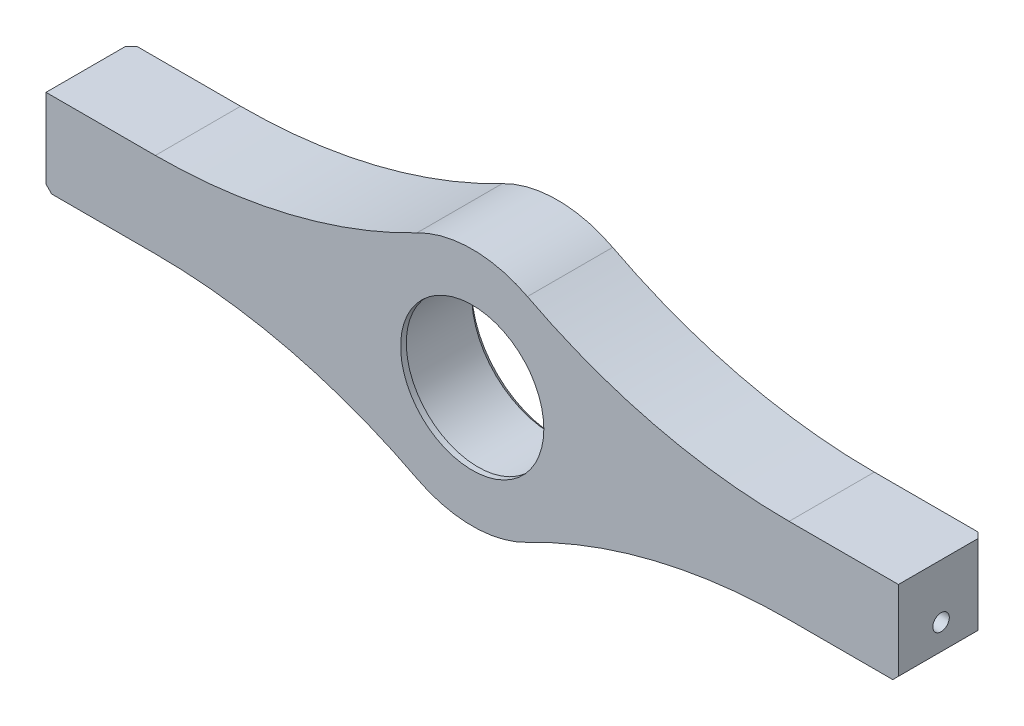
ISO-10303-21;
HEADER;
FILE_DESCRIPTION(('STEP AP214'),'2;1');
FILE_NAME('part.step','',(''),(''),'','','');
FILE_SCHEMA(('AUTOMOTIVE_DESIGN { 1 0 10303 214 1 1 1 1 }'));
ENDSEC;
DATA;
#1=APPLICATION_CONTEXT('core data for automotive mechanical design processes');
#2=APPLICATION_PROTOCOL_DEFINITION('international standard','automotive_design',2000,#1);
#3=PRODUCT_CONTEXT('',#1,'mechanical');
#4=PRODUCT('Part','Part','',(#3));
#5=PRODUCT_RELATED_PRODUCT_CATEGORY('part','',(#4));
#6=PRODUCT_DEFINITION_FORMATION('','',#4);
#7=PRODUCT_DEFINITION_CONTEXT('part definition',#1,'design');
#8=PRODUCT_DEFINITION('design','',#6,#7);
#9=PRODUCT_DEFINITION_SHAPE('','',#8);
#10=(LENGTH_UNIT() NAMED_UNIT(*) SI_UNIT(.MILLI.,.METRE.));
#11=(NAMED_UNIT(*) PLANE_ANGLE_UNIT() SI_UNIT($,.RADIAN.));
#12=(NAMED_UNIT(*) SI_UNIT($,.STERADIAN.) SOLID_ANGLE_UNIT());
#13=UNCERTAINTY_MEASURE_WITH_UNIT(LENGTH_MEASURE(1.E-05),#10,'distance_accuracy_value','');
#14=(GEOMETRIC_REPRESENTATION_CONTEXT(3) GLOBAL_UNCERTAINTY_ASSIGNED_CONTEXT((#13)) GLOBAL_UNIT_ASSIGNED_CONTEXT((#10,
#11,#12)) REPRESENTATION_CONTEXT('',''));
#15=CARTESIAN_POINT('',(0.,0.,0.));
#16=DIRECTION('',(0.,0.,1.));
#17=DIRECTION('',(1.,0.,0.));
#18=AXIS2_PLACEMENT_3D('',#15,#16,#17);
#19=CARTESIAN_POINT('',(0.,0.,15.));
#20=DIRECTION('',(0.,0.,-1.));
#21=DIRECTION('',(-1.,0.,0.));
#22=AXIS2_PLACEMENT_3D('',#19,#20,#21);
#23=CYLINDRICAL_SURFACE('',#22,14.1);
#24=CARTESIAN_POINT('',(0.,0.,1.00000000000001));
#25=DIRECTION('',(0.,0.,1.));
#26=DIRECTION('',(1.,0.,0.));
#27=AXIS2_PLACEMENT_3D('',#24,#25,#26);
#28=CIRCLE('',#27,14.1);
#29=CARTESIAN_POINT('',(14.1,0.,1.00000000000001));
#30=VERTEX_POINT('',#29);
#31=EDGE_CURVE('E212',#30,#30,#28,.F.);
#32=ORIENTED_EDGE('',*,*,#31,.T.);
#33=EDGE_LOOP('',(#32));
#34=FACE_BOUND('',#33,.T.);
#35=CARTESIAN_POINT('',(0.,0.,14.));
#36=DIRECTION('',(0.,0.,1.));
#37=DIRECTION('',(1.,0.,0.));
#38=AXIS2_PLACEMENT_3D('',#35,#36,#37);
#39=CIRCLE('',#38,14.1);
#40=CARTESIAN_POINT('',(14.1,0.,14.));
#41=VERTEX_POINT('',#40);
#42=EDGE_CURVE('E247',#41,#41,#39,.T.);
#43=ORIENTED_EDGE('',*,*,#42,.T.);
#44=EDGE_LOOP('',(#43));
#45=FACE_BOUND('',#44,.T.);
#46=ADVANCED_FACE('F33',(#34,#45),#23,.F.);
#47=CARTESIAN_POINT('',(0.,0.,15.));
#48=DIRECTION('',(0.,0.,1.));
#49=DIRECTION('',(1.,0.,0.));
#50=AXIS2_PLACEMENT_3D('',#47,#48,#49);
#51=PLANE('',#50);
#52=DIRECTION('',(0.,-1.,0.));
#53=VECTOR('',#52,1.);
#54=CARTESIAN_POINT('',(-75.,-7.5,15.));
#55=LINE('',#54,#53);
#56=CARTESIAN_POINT('',(-75.,7.5,15.));
#57=VERTEX_POINT('',#56);
#58=CARTESIAN_POINT('',(-75.,-6.49999999999998,15.));
#59=VERTEX_POINT('',#58);
#60=EDGE_CURVE('E281',#57,#59,#55,.T.);
#61=ORIENTED_EDGE('',*,*,#60,.T.);
#62=DIRECTION('',(-0.707106781186548,0.707106781186548,0.));
#63=VECTOR('',#62,1.);
#64=CARTESIAN_POINT('',(-40.75,-40.75,15.));
#65=LINE('',#64,#63);
#66=CARTESIAN_POINT('',(-74.,-7.5,15.));
#67=VERTEX_POINT('',#66);
#68=EDGE_CURVE('E223',#59,#67,#65,.F.);
#69=ORIENTED_EDGE('',*,*,#68,.T.);
#70=DIRECTION('',(1.,0.,0.));
#71=VECTOR('',#70,1.);
#72=CARTESIAN_POINT('',(-75.,-7.5,15.));
#73=LINE('',#72,#71);
#74=CARTESIAN_POINT('',(-55.758048746347,-7.5,15.));
#75=VERTEX_POINT('',#74);
#76=EDGE_CURVE('E283',#67,#75,#73,.T.);
#77=ORIENTED_EDGE('',*,*,#76,.T.);
#78=CARTESIAN_POINT('',(-55.758048746347,-107.5,15.));
#79=DIRECTION('',(0.,0.,1.));
#80=DIRECTION('',(1.,0.,0.));
#81=AXIS2_PLACEMENT_3D('',#78,#79,#80);
#82=CIRCLE('',#81,100.);
#83=CARTESIAN_POINT('',(-9.71506877413641,-18.7303881090008,15.));
#84=VERTEX_POINT('',#83);
#85=EDGE_CURVE('E198',#75,#84,#82,.F.);
#86=ORIENTED_EDGE('',*,*,#85,.T.);
#87=CARTESIAN_POINT('',(0.,0.,15.));
#88=DIRECTION('',(0.,0.,1.));
#89=DIRECTION('',(1.,0.,0.));
#90=AXIS2_PLACEMENT_3D('',#87,#88,#89);
#91=CIRCLE('',#90,21.1);
#92=CARTESIAN_POINT('',(9.71506877413644,-18.7303881090008,15.));
#93=VERTEX_POINT('',#92);
#94=EDGE_CURVE('E285',#84,#93,#91,.T.);
#95=ORIENTED_EDGE('',*,*,#94,.T.);
#96=CARTESIAN_POINT('',(55.758048746347,-107.5,15.));
#97=DIRECTION('',(0.,0.,1.));
#98=DIRECTION('',(1.,0.,0.));
#99=AXIS2_PLACEMENT_3D('',#96,#97,#98);
#100=CIRCLE('',#99,100.);
#101=CARTESIAN_POINT('',(55.758048746347,-7.5,15.));
#102=VERTEX_POINT('',#101);
#103=EDGE_CURVE('E193',#93,#102,#100,.F.);
#104=ORIENTED_EDGE('',*,*,#103,.T.);
#105=DIRECTION('',(1.,0.,0.));
#106=VECTOR('',#105,1.);
#107=CARTESIAN_POINT('',(19.7220688569937,-7.5,15.));
#108=LINE('',#107,#106);
#109=CARTESIAN_POINT('',(74.,-7.5,15.));
#110=VERTEX_POINT('',#109);
#111=EDGE_CURVE('E171',#102,#110,#108,.T.);
#112=ORIENTED_EDGE('',*,*,#111,.T.);
#113=DIRECTION('',(-0.707106781186548,-0.707106781186548,0.));
#114=VECTOR('',#113,1.);
#115=CARTESIAN_POINT('',(40.75,-40.75,15.));
#116=LINE('',#115,#114);
#117=CARTESIAN_POINT('',(75.,-6.49999999999998,15.));
#118=VERTEX_POINT('',#117);
#119=EDGE_CURVE('E152',#110,#118,#116,.F.);
#120=ORIENTED_EDGE('',*,*,#119,.T.);
#121=DIRECTION('',(0.,1.,0.));
#122=VECTOR('',#121,1.);
#123=CARTESIAN_POINT('',(75.,-7.5,15.));
#124=LINE('',#123,#122);
#125=CARTESIAN_POINT('',(75.,7.5,15.));
#126=VERTEX_POINT('',#125);
#127=EDGE_CURVE('E143',#118,#126,#124,.T.);
#128=ORIENTED_EDGE('',*,*,#127,.T.);
#129=DIRECTION('',(-1.,0.,0.));
#130=VECTOR('',#129,1.);
#131=CARTESIAN_POINT('',(19.7220688569937,7.5,15.));
#132=LINE('',#131,#130);
#133=CARTESIAN_POINT('',(55.758048746347,7.5,15.));
#134=VERTEX_POINT('',#133);
#135=EDGE_CURVE('E148',#126,#134,#132,.T.);
#136=ORIENTED_EDGE('',*,*,#135,.T.);
#137=CARTESIAN_POINT('',(55.758048746347,107.5,15.));
#138=DIRECTION('',(0.,0.,1.));
#139=DIRECTION('',(1.,0.,0.));
#140=AXIS2_PLACEMENT_3D('',#137,#138,#139);
#141=CIRCLE('',#140,100.);
#142=CARTESIAN_POINT('',(9.71506877413644,18.7303881090008,15.));
#143=VERTEX_POINT('',#142);
#144=EDGE_CURVE('E207',#134,#143,#141,.F.);
#145=ORIENTED_EDGE('',*,*,#144,.T.);
#146=CARTESIAN_POINT('',(0.,0.,15.));
#147=DIRECTION('',(0.,0.,1.));
#148=DIRECTION('',(1.,0.,0.));
#149=AXIS2_PLACEMENT_3D('',#146,#147,#148);
#150=CIRCLE('',#149,21.1);
#151=CARTESIAN_POINT('',(-9.71506877413641,18.7303881090008,15.));
#152=VERTEX_POINT('',#151);
#153=EDGE_CURVE('E161',#143,#152,#150,.T.);
#154=ORIENTED_EDGE('',*,*,#153,.T.);
#155=CARTESIAN_POINT('',(-55.758048746347,107.5,15.));
#156=DIRECTION('',(0.,0.,1.));
#157=DIRECTION('',(1.,0.,0.));
#158=AXIS2_PLACEMENT_3D('',#155,#156,#157);
#159=CIRCLE('',#158,100.);
#160=CARTESIAN_POINT('',(-55.758048746347,7.5,15.));
#161=VERTEX_POINT('',#160);
#162=EDGE_CURVE('E202',#152,#161,#159,.F.);
#163=ORIENTED_EDGE('',*,*,#162,.T.);
#164=DIRECTION('',(-1.,0.,0.));
#165=VECTOR('',#164,1.);
#166=CARTESIAN_POINT('',(-75.,7.5,15.));
#167=LINE('',#166,#165);
#168=EDGE_CURVE('E279',#161,#57,#167,.T.);
#169=ORIENTED_EDGE('',*,*,#168,.T.);
#170=EDGE_LOOP('',(#61,#69,#77,#86,#95,#104,#112,#120,#128,#136,#145,#154,#163,#169));
#171=FACE_BOUND('',#170,.T.);
#172=CARTESIAN_POINT('',(0.,0.,15.));
#173=DIRECTION('',(0.,0.,1.));
#174=DIRECTION('',(1.,0.,0.));
#175=AXIS2_PLACEMENT_3D('',#172,#173,#174);
#176=CIRCLE('',#175,12.6);
#177=CARTESIAN_POINT('',(12.6,0.,15.));
#178=VERTEX_POINT('',#177);
#179=EDGE_CURVE('E235',#178,#178,#176,.T.);
#180=ORIENTED_EDGE('',*,*,#179,.F.);
#181=EDGE_LOOP('',(#180));
#182=FACE_BOUND('',#181,.T.);
#183=ADVANCED_FACE('F146',(#171,#182),#51,.T.);
#184=CARTESIAN_POINT('',(0.,0.,0.));
#185=DIRECTION('',(0.,0.,1.));
#186=DIRECTION('',(1.,0.,0.));
#187=AXIS2_PLACEMENT_3D('',#184,#185,#186);
#188=PLANE('',#187);
#189=CARTESIAN_POINT('',(0.,0.,0.));
#190=DIRECTION('',(0.,0.,1.));
#191=DIRECTION('',(1.,0.,0.));
#192=AXIS2_PLACEMENT_3D('',#189,#190,#191);
#193=CIRCLE('',#192,15.1);
#194=CARTESIAN_POINT('',(15.1,0.,0.));
#195=VERTEX_POINT('',#194);
#196=EDGE_CURVE('E209',#195,#195,#193,.T.);
#197=ORIENTED_EDGE('',*,*,#196,.T.);
#198=EDGE_LOOP('',(#197));
#199=FACE_BOUND('',#198,.T.);
#200=CARTESIAN_POINT('',(67.5,2.,0.));
#201=DIRECTION('',(0.,0.,-1.));
#202=DIRECTION('',(-1.,0.,0.));
#203=AXIS2_PLACEMENT_3D('',#200,#201,#202);
#204=CIRCLE('',#203,1.4);
#205=CARTESIAN_POINT('',(66.1,2.,0.));
#206=VERTEX_POINT('',#205);
#207=EDGE_CURVE('E269',#206,#206,#204,.T.);
#208=ORIENTED_EDGE('',*,*,#207,.F.);
#209=EDGE_LOOP('',(#208));
#210=FACE_BOUND('',#209,.T.);
#211=CARTESIAN_POINT('',(-67.5,2.,0.));
#212=DIRECTION('',(0.,0.,-1.));
#213=DIRECTION('',(1.,0.,0.));
#214=AXIS2_PLACEMENT_3D('',#211,#212,#213);
#215=CIRCLE('',#214,1.4);
#216=CARTESIAN_POINT('',(-66.1,2.,0.));
#217=VERTEX_POINT('',#216);
#218=EDGE_CURVE('E262',#217,#217,#215,.T.);
#219=ORIENTED_EDGE('',*,*,#218,.F.);
#220=EDGE_LOOP('',(#219));
#221=FACE_BOUND('',#220,.T.);
#222=DIRECTION('',(1.,0.,0.));
#223=VECTOR('',#222,1.);
#224=CARTESIAN_POINT('',(-75.,-7.5,0.));
#225=LINE('',#224,#223);
#226=CARTESIAN_POINT('',(-74.,-7.5,0.));
#227=VERTEX_POINT('',#226);
#228=CARTESIAN_POINT('',(-55.758048746347,-7.5,0.));
#229=VERTEX_POINT('',#228);
#230=EDGE_CURVE('E296',#227,#229,#225,.T.);
#231=ORIENTED_EDGE('',*,*,#230,.F.);
#232=DIRECTION('',(0.,1.,0.));
#233=VECTOR('',#232,1.);
#234=CARTESIAN_POINT('',(-74.,0.,0.));
#235=LINE('',#234,#233);
#236=CARTESIAN_POINT('',(-74.,7.5,0.));
#237=VERTEX_POINT('',#236);
#238=EDGE_CURVE('E227',#227,#237,#235,.T.);
#239=ORIENTED_EDGE('',*,*,#238,.T.);
#240=DIRECTION('',(-1.,0.,0.));
#241=VECTOR('',#240,1.);
#242=CARTESIAN_POINT('',(-75.,7.5,0.));
#243=LINE('',#242,#241);
#244=CARTESIAN_POINT('',(-55.758048746347,7.5,0.));
#245=VERTEX_POINT('',#244);
#246=EDGE_CURVE('E293',#245,#237,#243,.T.);
#247=ORIENTED_EDGE('',*,*,#246,.F.);
#248=CARTESIAN_POINT('',(-55.758048746347,107.5,0.));
#249=DIRECTION('',(0.,0.,1.));
#250=DIRECTION('',(1.,0.,0.));
#251=AXIS2_PLACEMENT_3D('',#248,#249,#250);
#252=CIRCLE('',#251,100.);
#253=CARTESIAN_POINT('',(-9.71506877413641,18.7303881090008,0.));
#254=VERTEX_POINT('',#253);
#255=EDGE_CURVE('E200',#245,#254,#252,.T.);
#256=ORIENTED_EDGE('',*,*,#255,.T.);
#257=CARTESIAN_POINT('',(0.,0.,0.));
#258=DIRECTION('',(0.,0.,1.));
#259=DIRECTION('',(1.,0.,0.));
#260=AXIS2_PLACEMENT_3D('',#257,#258,#259);
#261=CIRCLE('',#260,21.1);
#262=CARTESIAN_POINT('',(9.71506877413644,18.7303881090008,0.));
#263=VERTEX_POINT('',#262);
#264=EDGE_CURVE('E290',#263,#254,#261,.T.);
#265=ORIENTED_EDGE('',*,*,#264,.F.);
#266=CARTESIAN_POINT('',(55.758048746347,107.5,0.));
#267=DIRECTION('',(0.,0.,1.));
#268=DIRECTION('',(1.,0.,0.));
#269=AXIS2_PLACEMENT_3D('',#266,#267,#268);
#270=CIRCLE('',#269,100.);
#271=CARTESIAN_POINT('',(55.758048746347,7.5,0.));
#272=VERTEX_POINT('',#271);
#273=EDGE_CURVE('E204',#263,#272,#270,.T.);
#274=ORIENTED_EDGE('',*,*,#273,.T.);
#275=DIRECTION('',(-1.,0.,0.));
#276=VECTOR('',#275,1.);
#277=CARTESIAN_POINT('',(19.7220688569937,7.5,0.));
#278=LINE('',#277,#276);
#279=CARTESIAN_POINT('',(74.,7.5,0.));
#280=VERTEX_POINT('',#279);
#281=EDGE_CURVE('E268',#280,#272,#278,.T.);
#282=ORIENTED_EDGE('',*,*,#281,.F.);
#283=DIRECTION('',(0.,-1.,0.));
#284=VECTOR('',#283,1.);
#285=CARTESIAN_POINT('',(74.,0.,0.));
#286=LINE('',#285,#284);
#287=CARTESIAN_POINT('',(74.,-7.5,0.));
#288=VERTEX_POINT('',#287);
#289=EDGE_CURVE('E225',#280,#288,#286,.T.);
#290=ORIENTED_EDGE('',*,*,#289,.T.);
#291=DIRECTION('',(1.,0.,0.));
#292=VECTOR('',#291,1.);
#293=CARTESIAN_POINT('',(19.7220688569937,-7.5,0.));
#294=LINE('',#293,#292);
#295=CARTESIAN_POINT('',(55.758048746347,-7.5,0.));
#296=VERTEX_POINT('',#295);
#297=EDGE_CURVE('E153',#296,#288,#294,.T.);
#298=ORIENTED_EDGE('',*,*,#297,.F.);
#299=CARTESIAN_POINT('',(55.758048746347,-107.5,0.));
#300=DIRECTION('',(0.,0.,1.));
#301=DIRECTION('',(1.,0.,0.));
#302=AXIS2_PLACEMENT_3D('',#299,#300,#301);
#303=CIRCLE('',#302,100.);
#304=CARTESIAN_POINT('',(9.71506877413644,-18.7303881090008,0.));
#305=VERTEX_POINT('',#304);
#306=EDGE_CURVE('E191',#296,#305,#303,.T.);
#307=ORIENTED_EDGE('',*,*,#306,.T.);
#308=CARTESIAN_POINT('',(0.,0.,0.));
#309=DIRECTION('',(0.,0.,1.));
#310=DIRECTION('',(1.,0.,0.));
#311=AXIS2_PLACEMENT_3D('',#308,#309,#310);
#312=CIRCLE('',#311,21.1);
#313=CARTESIAN_POINT('',(-9.71506877413641,-18.7303881090008,0.));
#314=VERTEX_POINT('',#313);
#315=EDGE_CURVE('E298',#314,#305,#312,.T.);
#316=ORIENTED_EDGE('',*,*,#315,.F.);
#317=CARTESIAN_POINT('',(-55.758048746347,-107.5,0.));
#318=DIRECTION('',(0.,0.,1.));
#319=DIRECTION('',(1.,0.,0.));
#320=AXIS2_PLACEMENT_3D('',#317,#318,#319);
#321=CIRCLE('',#320,100.);
#322=EDGE_CURVE('E195',#314,#229,#321,.T.);
#323=ORIENTED_EDGE('',*,*,#322,.T.);
#324=EDGE_LOOP('',(#231,#239,#247,#256,#265,#274,#282,#290,#298,#307,#316,#323));
#325=FACE_BOUND('',#324,.T.);
#326=ADVANCED_FACE('F312',(#199,#210,#221,#325),#188,.F.);
#327=CARTESIAN_POINT('',(75.,-7.5,15.));
#328=DIRECTION('',(-1.,0.,0.));
#329=DIRECTION('',(0.,0.,1.));
#330=AXIS2_PLACEMENT_3D('',#327,#328,#329);
#331=PLANE('',#330);
#332=CARTESIAN_POINT('',(75.,-2.,7.5));
#333=DIRECTION('',(1.,0.,0.));
#334=DIRECTION('',(0.,0.,-1.));
#335=AXIS2_PLACEMENT_3D('',#332,#333,#334);
#336=CIRCLE('',#335,1.45);
#337=CARTESIAN_POINT('',(75.,-2.,6.05));
#338=VERTEX_POINT('',#337);
#339=EDGE_CURVE('E256',#338,#338,#336,.T.);
#340=ORIENTED_EDGE('',*,*,#339,.F.);
#341=EDGE_LOOP('',(#340));
#342=FACE_BOUND('',#341,.T.);
#343=ORIENTED_EDGE('',*,*,#127,.F.);
#344=DIRECTION('',(0.,0.,-1.));
#345=VECTOR('',#344,1.);
#346=CARTESIAN_POINT('',(75.,-6.49999999999998,15.));
#347=LINE('',#346,#345);
#348=CARTESIAN_POINT('',(75.,-6.49999999999998,1.00000000000001));
#349=VERTEX_POINT('',#348);
#350=EDGE_CURVE('E232',#118,#349,#347,.T.);
#351=ORIENTED_EDGE('',*,*,#350,.T.);
#352=DIRECTION('',(0.,1.,0.));
#353=VECTOR('',#352,1.);
#354=CARTESIAN_POINT('',(75.,-7.5,1.00000000000001));
#355=LINE('',#354,#353);
#356=CARTESIAN_POINT('',(75.,7.5,1.00000000000001));
#357=VERTEX_POINT('',#356);
#358=EDGE_CURVE('E56',#349,#357,#355,.T.);
#359=ORIENTED_EDGE('',*,*,#358,.T.);
#360=DIRECTION('',(0.,0.,-1.));
#361=VECTOR('',#360,1.);
#362=CARTESIAN_POINT('',(75.,7.5,15.));
#363=LINE('',#362,#361);
#364=EDGE_CURVE('E157',#126,#357,#363,.T.);
#365=ORIENTED_EDGE('',*,*,#364,.F.);
#366=EDGE_LOOP('',(#343,#351,#359,#365));
#367=FACE_BOUND('',#366,.T.);
#368=ADVANCED_FACE('F163',(#342,#367),#331,.F.);
#369=CARTESIAN_POINT('',(19.7220688569937,7.5,15.));
#370=DIRECTION('',(0.,-1.,0.));
#371=DIRECTION('',(0.,0.,-1.));
#372=AXIS2_PLACEMENT_3D('',#369,#370,#371);
#373=PLANE('',#372);
#374=ORIENTED_EDGE('',*,*,#364,.T.);
#375=DIRECTION('',(0.707106781186548,0.,0.707106781186548));
#376=VECTOR('',#375,1.);
#377=CARTESIAN_POINT('',(75.,7.5,1.00000000000001));
#378=LINE('',#377,#376);
#379=EDGE_CURVE('E11',#357,#280,#378,.F.);
#380=ORIENTED_EDGE('',*,*,#379,.T.);
#381=ORIENTED_EDGE('',*,*,#281,.T.);
#382=DIRECTION('',(0.,0.,1.));
#383=VECTOR('',#382,1.);
#384=CARTESIAN_POINT('',(55.758048746347,7.5,15.));
#385=LINE('',#384,#383);
#386=EDGE_CURVE('E160',#272,#134,#385,.T.);
#387=ORIENTED_EDGE('',*,*,#386,.T.);
#388=ORIENTED_EDGE('',*,*,#135,.F.);
#389=EDGE_LOOP('',(#374,#380,#381,#387,#388));
#390=FACE_BOUND('',#389,.T.);
#391=ADVANCED_FACE('F156',(#390),#373,.F.);
#392=CARTESIAN_POINT('',(0.,0.,15.));
#393=DIRECTION('',(0.,0.,-1.));
#394=DIRECTION('',(-1.,0.,0.));
#395=AXIS2_PLACEMENT_3D('',#392,#393,#394);
#396=CYLINDRICAL_SURFACE('',#395,21.1);
#397=ORIENTED_EDGE('',*,*,#264,.T.);
#398=DIRECTION('',(0.,0.,-1.));
#399=VECTOR('',#398,1.);
#400=CARTESIAN_POINT('',(-9.71506877413641,18.7303881090008,15.));
#401=LINE('',#400,#399);
#402=EDGE_CURVE('E188',#254,#152,#401,.F.);
#403=ORIENTED_EDGE('',*,*,#402,.T.);
#404=ORIENTED_EDGE('',*,*,#153,.F.);
#405=DIRECTION('',(0.,0.,-1.));
#406=VECTOR('',#405,1.);
#407=CARTESIAN_POINT('',(9.71506877413644,18.7303881090008,15.));
#408=LINE('',#407,#406);
#409=EDGE_CURVE('E185',#143,#263,#408,.T.);
#410=ORIENTED_EDGE('',*,*,#409,.T.);
#411=EDGE_LOOP('',(#397,#403,#404,#410));
#412=FACE_BOUND('',#411,.T.);
#413=ADVANCED_FACE('F320',(#412),#396,.T.);
#414=CARTESIAN_POINT('',(-75.,7.5,15.));
#415=DIRECTION('',(0.,-1.,0.));
#416=DIRECTION('',(0.,0.,-1.));
#417=AXIS2_PLACEMENT_3D('',#414,#415,#416);
#418=PLANE('',#417);
#419=ORIENTED_EDGE('',*,*,#246,.T.);
#420=DIRECTION('',(0.707106781186548,0.,-0.707106781186548));
#421=VECTOR('',#420,1.);
#422=CARTESIAN_POINT('',(-75.,7.5,1.00000000000001));
#423=LINE('',#422,#421);
#424=CARTESIAN_POINT('',(-75.,7.5,1.00000000000001));
#425=VERTEX_POINT('',#424);
#426=EDGE_CURVE('E229',#237,#425,#423,.F.);
#427=ORIENTED_EDGE('',*,*,#426,.T.);
#428=DIRECTION('',(0.,0.,-1.));
#429=VECTOR('',#428,1.);
#430=CARTESIAN_POINT('',(-75.,7.5,15.));
#431=LINE('',#430,#429);
#432=EDGE_CURVE('E165',#57,#425,#431,.T.);
#433=ORIENTED_EDGE('',*,*,#432,.F.);
#434=ORIENTED_EDGE('',*,*,#168,.F.);
#435=DIRECTION('',(0.,0.,1.));
#436=VECTOR('',#435,1.);
#437=CARTESIAN_POINT('',(-55.758048746347,7.5,0.));
#438=LINE('',#437,#436);
#439=EDGE_CURVE('E182',#161,#245,#438,.F.);
#440=ORIENTED_EDGE('',*,*,#439,.T.);
#441=EDGE_LOOP('',(#419,#427,#433,#434,#440));
#442=FACE_BOUND('',#441,.T.);
#443=ADVANCED_FACE('F328',(#442),#418,.F.);
#444=CARTESIAN_POINT('',(-75.,-7.5,15.));
#445=DIRECTION('',(1.,0.,0.));
#446=DIRECTION('',(0.,0.,-1.));
#447=AXIS2_PLACEMENT_3D('',#444,#445,#446);
#448=PLANE('',#447);
#449=CARTESIAN_POINT('',(-75.,-2.,7.5));
#450=DIRECTION('',(1.,0.,0.));
#451=DIRECTION('',(0.,0.,-1.));
#452=AXIS2_PLACEMENT_3D('',#449,#450,#451);
#453=CIRCLE('',#452,1.45);
#454=CARTESIAN_POINT('',(-75.,-2.,6.05));
#455=VERTEX_POINT('',#454);
#456=EDGE_CURVE('E252',#455,#455,#453,.T.);
#457=ORIENTED_EDGE('',*,*,#456,.T.);
#458=EDGE_LOOP('',(#457));
#459=FACE_BOUND('',#458,.T.);
#460=DIRECTION('',(0.,-1.,0.));
#461=VECTOR('',#460,1.);
#462=CARTESIAN_POINT('',(-75.,-7.5,1.00000000000001));
#463=LINE('',#462,#461);
#464=CARTESIAN_POINT('',(-75.,-6.49999999999998,1.00000000000001));
#465=VERTEX_POINT('',#464);
#466=EDGE_CURVE('E218',#425,#465,#463,.T.);
#467=ORIENTED_EDGE('',*,*,#466,.T.);
#468=DIRECTION('',(0.,0.,1.));
#469=VECTOR('',#468,1.);
#470=CARTESIAN_POINT('',(-75.,-6.49999999999998,15.));
#471=LINE('',#470,#469);
#472=EDGE_CURVE('E220',#465,#59,#471,.T.);
#473=ORIENTED_EDGE('',*,*,#472,.T.);
#474=ORIENTED_EDGE('',*,*,#60,.F.);
#475=ORIENTED_EDGE('',*,*,#432,.T.);
#476=EDGE_LOOP('',(#467,#473,#474,#475));
#477=FACE_BOUND('',#476,.T.);
#478=ADVANCED_FACE('F334',(#459,#477),#448,.F.);
#479=CARTESIAN_POINT('',(-75.,-7.5,15.));
#480=DIRECTION('',(0.,1.,0.));
#481=DIRECTION('',(0.,0.,1.));
#482=AXIS2_PLACEMENT_3D('',#479,#480,#481);
#483=PLANE('',#482);
#484=ORIENTED_EDGE('',*,*,#76,.F.);
#485=DIRECTION('',(0.,0.,-1.));
#486=VECTOR('',#485,1.);
#487=CARTESIAN_POINT('',(-74.,-7.5,15.));
#488=LINE('',#487,#486);
#489=EDGE_CURVE('E215',#67,#227,#488,.T.);
#490=ORIENTED_EDGE('',*,*,#489,.T.);
#491=ORIENTED_EDGE('',*,*,#230,.T.);
#492=DIRECTION('',(0.,0.,1.));
#493=VECTOR('',#492,1.);
#494=CARTESIAN_POINT('',(-55.758048746347,-7.5,15.));
#495=LINE('',#494,#493);
#496=EDGE_CURVE('E179',#229,#75,#495,.T.);
#497=ORIENTED_EDGE('',*,*,#496,.T.);
#498=EDGE_LOOP('',(#484,#490,#491,#497));
#499=FACE_BOUND('',#498,.T.);
#500=ADVANCED_FACE('F339',(#499),#483,.F.);
#501=CARTESIAN_POINT('',(0.,0.,15.));
#502=DIRECTION('',(0.,0.,-1.));
#503=DIRECTION('',(-1.,0.,0.));
#504=AXIS2_PLACEMENT_3D('',#501,#502,#503);
#505=CYLINDRICAL_SURFACE('',#504,21.1);
#506=ORIENTED_EDGE('',*,*,#315,.T.);
#507=DIRECTION('',(0.,0.,-1.));
#508=VECTOR('',#507,1.);
#509=CARTESIAN_POINT('',(9.71506877413644,-18.7303881090008,15.));
#510=LINE('',#509,#508);
#511=EDGE_CURVE('E177',#305,#93,#510,.F.);
#512=ORIENTED_EDGE('',*,*,#511,.T.);
#513=ORIENTED_EDGE('',*,*,#94,.F.);
#514=DIRECTION('',(0.,0.,-1.));
#515=VECTOR('',#514,1.);
#516=CARTESIAN_POINT('',(-9.71506877413641,-18.7303881090008,15.));
#517=LINE('',#516,#515);
#518=EDGE_CURVE('E168',#84,#314,#517,.T.);
#519=ORIENTED_EDGE('',*,*,#518,.T.);
#520=EDGE_LOOP('',(#506,#512,#513,#519));
#521=FACE_BOUND('',#520,.T.);
#522=ADVANCED_FACE('F349',(#521),#505,.T.);
#523=CARTESIAN_POINT('',(19.7220688569937,-7.5,15.));
#524=DIRECTION('',(0.,1.,0.));
#525=DIRECTION('',(0.,0.,1.));
#526=AXIS2_PLACEMENT_3D('',#523,#524,#525);
#527=PLANE('',#526);
#528=ORIENTED_EDGE('',*,*,#297,.T.);
#529=DIRECTION('',(0.,0.,1.));
#530=VECTOR('',#529,1.);
#531=CARTESIAN_POINT('',(74.,-7.5,15.));
#532=LINE('',#531,#530);
#533=EDGE_CURVE('E42',#288,#110,#532,.T.);
#534=ORIENTED_EDGE('',*,*,#533,.T.);
#535=ORIENTED_EDGE('',*,*,#111,.F.);
#536=DIRECTION('',(0.,0.,1.));
#537=VECTOR('',#536,1.);
#538=CARTESIAN_POINT('',(55.758048746347,-7.5,0.));
#539=LINE('',#538,#537);
#540=EDGE_CURVE('E164',#102,#296,#539,.F.);
#541=ORIENTED_EDGE('',*,*,#540,.T.);
#542=EDGE_LOOP('',(#528,#534,#535,#541));
#543=FACE_BOUND('',#542,.T.);
#544=ADVANCED_FACE('F303',(#543),#527,.F.);
#545=CARTESIAN_POINT('',(55.758048746347,-107.5,15.));
#546=DIRECTION('',(0.,0.,-1.));
#547=DIRECTION('',(-1.,0.,0.));
#548=AXIS2_PLACEMENT_3D('',#545,#546,#547);
#549=CYLINDRICAL_SURFACE('',#548,100.);
#550=ORIENTED_EDGE('',*,*,#103,.F.);
#551=ORIENTED_EDGE('',*,*,#511,.F.);
#552=ORIENTED_EDGE('',*,*,#306,.F.);
#553=ORIENTED_EDGE('',*,*,#540,.F.);
#554=EDGE_LOOP('',(#550,#551,#552,#553));
#555=FACE_BOUND('',#554,.T.);
#556=ADVANCED_FACE('F352',(#555),#549,.F.);
#557=CARTESIAN_POINT('',(-55.758048746347,-107.5,15.));
#558=DIRECTION('',(0.,0.,-1.));
#559=DIRECTION('',(-1.,0.,0.));
#560=AXIS2_PLACEMENT_3D('',#557,#558,#559);
#561=CYLINDRICAL_SURFACE('',#560,100.);
#562=ORIENTED_EDGE('',*,*,#85,.F.);
#563=ORIENTED_EDGE('',*,*,#496,.F.);
#564=ORIENTED_EDGE('',*,*,#322,.F.);
#565=ORIENTED_EDGE('',*,*,#518,.F.);
#566=EDGE_LOOP('',(#562,#563,#564,#565));
#567=FACE_BOUND('',#566,.T.);
#568=ADVANCED_FACE('F345',(#567),#561,.F.);
#569=CARTESIAN_POINT('',(-55.758048746347,107.5,15.));
#570=DIRECTION('',(0.,0.,-1.));
#571=DIRECTION('',(-1.,0.,0.));
#572=AXIS2_PLACEMENT_3D('',#569,#570,#571);
#573=CYLINDRICAL_SURFACE('',#572,100.);
#574=ORIENTED_EDGE('',*,*,#162,.F.);
#575=ORIENTED_EDGE('',*,*,#402,.F.);
#576=ORIENTED_EDGE('',*,*,#255,.F.);
#577=ORIENTED_EDGE('',*,*,#439,.F.);
#578=EDGE_LOOP('',(#574,#575,#576,#577));
#579=FACE_BOUND('',#578,.T.);
#580=ADVANCED_FACE('F323',(#579),#573,.F.);
#581=CARTESIAN_POINT('',(55.758048746347,107.5,15.));
#582=DIRECTION('',(0.,0.,-1.));
#583=DIRECTION('',(-1.,0.,0.));
#584=AXIS2_PLACEMENT_3D('',#581,#582,#583);
#585=CYLINDRICAL_SURFACE('',#584,100.);
#586=ORIENTED_EDGE('',*,*,#144,.F.);
#587=ORIENTED_EDGE('',*,*,#386,.F.);
#588=ORIENTED_EDGE('',*,*,#273,.F.);
#589=ORIENTED_EDGE('',*,*,#409,.F.);
#590=EDGE_LOOP('',(#586,#587,#588,#589));
#591=FACE_BOUND('',#590,.T.);
#592=ADVANCED_FACE('F316',(#591),#585,.F.);
#593=CARTESIAN_POINT('',(-67.5,2.,10.));
#594=DIRECTION('',(0.,0.,-1.));
#595=DIRECTION('',(-1.,0.,0.));
#596=AXIS2_PLACEMENT_3D('',#593,#594,#595);
#597=CYLINDRICAL_SURFACE('',#596,1.4);
#598=CARTESIAN_POINT('',(-67.5,2.,10.));
#599=DIRECTION('',(0.,0.,-1.));
#600=DIRECTION('',(1.,0.,0.));
#601=AXIS2_PLACEMENT_3D('',#598,#599,#600);
#602=CIRCLE('',#601,1.4);
#603=CARTESIAN_POINT('',(-66.1,2.,10.));
#604=VERTEX_POINT('',#603);
#605=EDGE_CURVE('E272',#604,#604,#602,.T.);
#606=ORIENTED_EDGE('',*,*,#605,.F.);
#607=EDGE_LOOP('',(#606));
#608=FACE_BOUND('',#607,.T.);
#609=ORIENTED_EDGE('',*,*,#218,.T.);
#610=EDGE_LOOP('',(#609));
#611=FACE_BOUND('',#610,.T.);
#612=ADVANCED_FACE('F371',(#608,#611),#597,.F.);
#613=CARTESIAN_POINT('',(-67.5,2.,10.));
#614=DIRECTION('',(0.,0.,1.));
#615=DIRECTION('',(1.,0.,0.));
#616=AXIS2_PLACEMENT_3D('',#613,#614,#615);
#617=PLANE('',#616);
#618=ORIENTED_EDGE('',*,*,#605,.T.);
#619=EDGE_LOOP('',(#618));
#620=FACE_BOUND('',#619,.T.);
#621=ADVANCED_FACE('F415',(#620),#617,.F.);
#622=CARTESIAN_POINT('',(67.5,2.,10.));
#623=DIRECTION('',(0.,0.,-1.));
#624=DIRECTION('',(-1.,0.,0.));
#625=AXIS2_PLACEMENT_3D('',#622,#623,#624);
#626=CYLINDRICAL_SURFACE('',#625,1.4);
#627=CARTESIAN_POINT('',(67.5,2.,10.));
#628=DIRECTION('',(0.,0.,-1.));
#629=DIRECTION('',(-1.,0.,0.));
#630=AXIS2_PLACEMENT_3D('',#627,#628,#629);
#631=CIRCLE('',#630,1.4);
#632=CARTESIAN_POINT('',(66.1,2.,10.));
#633=VERTEX_POINT('',#632);
#634=EDGE_CURVE('E265',#633,#633,#631,.T.);
#635=ORIENTED_EDGE('',*,*,#634,.F.);
#636=EDGE_LOOP('',(#635));
#637=FACE_BOUND('',#636,.T.);
#638=ORIENTED_EDGE('',*,*,#207,.T.);
#639=EDGE_LOOP('',(#638));
#640=FACE_BOUND('',#639,.T.);
#641=ADVANCED_FACE('F408',(#637,#640),#626,.F.);
#642=CARTESIAN_POINT('',(67.5,2.,10.));
#643=DIRECTION('',(0.,0.,-1.));
#644=DIRECTION('',(-1.,0.,0.));
#645=AXIS2_PLACEMENT_3D('',#642,#643,#644);
#646=PLANE('',#645);
#647=ORIENTED_EDGE('',*,*,#634,.T.);
#648=EDGE_LOOP('',(#647));
#649=FACE_BOUND('',#648,.T.);
#650=ADVANCED_FACE('F398',(#649),#646,.T.);
#651=CARTESIAN_POINT('',(65.,-2.,7.5));
#652=DIRECTION('',(1.,0.,0.));
#653=DIRECTION('',(0.,0.,-1.));
#654=AXIS2_PLACEMENT_3D('',#651,#652,#653);
#655=CYLINDRICAL_SURFACE('',#654,1.45);
#656=CARTESIAN_POINT('',(65.,-2.,7.5));
#657=DIRECTION('',(1.,0.,0.));
#658=DIRECTION('',(0.,0.,-1.));
#659=AXIS2_PLACEMENT_3D('',#656,#657,#658);
#660=CIRCLE('',#659,1.45);
#661=CARTESIAN_POINT('',(65.,-2.,6.05));
#662=VERTEX_POINT('',#661);
#663=EDGE_CURVE('E259',#662,#662,#660,.T.);
#664=ORIENTED_EDGE('',*,*,#663,.F.);
#665=EDGE_LOOP('',(#664));
#666=FACE_BOUND('',#665,.T.);
#667=ORIENTED_EDGE('',*,*,#339,.T.);
#668=EDGE_LOOP('',(#667));
#669=FACE_BOUND('',#668,.T.);
#670=ADVANCED_FACE('F395',(#666,#669),#655,.F.);
#671=CARTESIAN_POINT('',(65.,-2.,7.5));
#672=DIRECTION('',(1.,0.,0.));
#673=DIRECTION('',(0.,0.,-1.));
#674=AXIS2_PLACEMENT_3D('',#671,#672,#673);
#675=PLANE('',#674);
#676=ORIENTED_EDGE('',*,*,#663,.T.);
#677=EDGE_LOOP('',(#676));
#678=FACE_BOUND('',#677,.T.);
#679=ADVANCED_FACE('F397',(#678),#675,.T.);
#680=CARTESIAN_POINT('',(-65.,-2.,7.5));
#681=DIRECTION('',(-1.,0.,0.));
#682=DIRECTION('',(0.,0.,1.));
#683=AXIS2_PLACEMENT_3D('',#680,#681,#682);
#684=CYLINDRICAL_SURFACE('',#683,1.45);
#685=CARTESIAN_POINT('',(-65.,-2.,7.5));
#686=DIRECTION('',(1.,0.,0.));
#687=DIRECTION('',(0.,0.,-1.));
#688=AXIS2_PLACEMENT_3D('',#685,#686,#687);
#689=CIRCLE('',#688,1.45);
#690=CARTESIAN_POINT('',(-65.,-2.,6.05));
#691=VERTEX_POINT('',#690);
#692=EDGE_CURVE('E253',#691,#691,#689,.T.);
#693=ORIENTED_EDGE('',*,*,#692,.T.);
#694=EDGE_LOOP('',(#693));
#695=FACE_BOUND('',#694,.T.);
#696=ORIENTED_EDGE('',*,*,#456,.F.);
#697=EDGE_LOOP('',(#696));
#698=FACE_BOUND('',#697,.T.);
#699=ADVANCED_FACE('F405',(#695,#698),#684,.F.);
#700=CARTESIAN_POINT('',(-65.,-2.,7.5));
#701=DIRECTION('',(-1.,0.,0.));
#702=DIRECTION('',(0.,0.,-1.));
#703=AXIS2_PLACEMENT_3D('',#700,#701,#702);
#704=PLANE('',#703);
#705=ORIENTED_EDGE('',*,*,#692,.F.);
#706=EDGE_LOOP('',(#705));
#707=FACE_BOUND('',#706,.T.);
#708=ADVANCED_FACE('F480',(#707),#704,.T.);
#709=CARTESIAN_POINT('',(0.,0.,14.));
#710=DIRECTION('',(0.,0.,1.));
#711=DIRECTION('',(1.,0.,0.));
#712=AXIS2_PLACEMENT_3D('',#709,#710,#711);
#713=PLANE('',#712);
#714=CARTESIAN_POINT('',(0.,0.,14.));
#715=DIRECTION('',(0.,0.,1.));
#716=DIRECTION('',(1.,0.,0.));
#717=AXIS2_PLACEMENT_3D('',#714,#715,#716);
#718=CIRCLE('',#717,12.6);
#719=CARTESIAN_POINT('',(12.6,0.,14.));
#720=VERTEX_POINT('',#719);
#721=EDGE_CURVE('E242',#720,#720,#718,.T.);
#722=ORIENTED_EDGE('',*,*,#721,.T.);
#723=EDGE_LOOP('',(#722));
#724=FACE_BOUND('',#723,.T.);
#725=ORIENTED_EDGE('',*,*,#42,.F.);
#726=EDGE_LOOP('',(#725));
#727=FACE_BOUND('',#726,.T.);
#728=ADVANCED_FACE('F472',(#724,#727),#713,.F.);
#729=CARTESIAN_POINT('',(0.,0.,14.));
#730=DIRECTION('',(0.,0.,1.));
#731=DIRECTION('',(1.,0.,0.));
#732=AXIS2_PLACEMENT_3D('',#729,#730,#731);
#733=CYLINDRICAL_SURFACE('',#732,12.6);
#734=ORIENTED_EDGE('',*,*,#721,.F.);
#735=EDGE_LOOP('',(#734));
#736=FACE_BOUND('',#735,.T.);
#737=ORIENTED_EDGE('',*,*,#179,.T.);
#738=EDGE_LOOP('',(#737));
#739=FACE_BOUND('',#738,.T.);
#740=ADVANCED_FACE('F440',(#736,#739),#733,.F.);
#741=CARTESIAN_POINT('',(0.,0.,0.));
#742=DIRECTION('',(0.,0.,-1.));
#743=DIRECTION('',(-1.,0.,0.));
#744=AXIS2_PLACEMENT_3D('',#741,#742,#743);
#745=CONICAL_SURFACE('',#744,15.1,0.785398163397452);
#746=ORIENTED_EDGE('',*,*,#31,.F.);
#747=EDGE_LOOP('',(#746));
#748=FACE_BOUND('',#747,.T.);
#749=ORIENTED_EDGE('',*,*,#196,.F.);
#750=EDGE_LOOP('',(#749));
#751=FACE_BOUND('',#750,.T.);
#752=ADVANCED_FACE('F436',(#748,#751),#745,.F.);
#753=CARTESIAN_POINT('',(-75.,-7.5,1.00000000000001));
#754=DIRECTION('',(0.707106781186547,0.,0.707106781186547));
#755=DIRECTION('',(0.,-1.,0.));
#756=AXIS2_PLACEMENT_3D('',#753,#754,#755);
#757=PLANE('',#756);
#758=ORIENTED_EDGE('',*,*,#426,.F.);
#759=ORIENTED_EDGE('',*,*,#238,.F.);
#760=DIRECTION('',(-0.577350269189626,0.577350269189626,0.577350269189626));
#761=VECTOR('',#760,1.);
#762=CARTESIAN_POINT('',(-74.6666666666667,-6.83333333333332,0.666666666666677));
#763=LINE('',#762,#761);
#764=EDGE_CURVE('E234',#465,#227,#763,.F.);
#765=ORIENTED_EDGE('',*,*,#764,.F.);
#766=ORIENTED_EDGE('',*,*,#466,.F.);
#767=EDGE_LOOP('',(#758,#759,#765,#766));
#768=FACE_BOUND('',#767,.T.);
#769=ADVANCED_FACE('F439',(#768),#757,.F.);
#770=CARTESIAN_POINT('',(-74.,-7.5,15.));
#771=DIRECTION('',(0.707106781186547,0.707106781186547,0.));
#772=DIRECTION('',(0.,0.,-1.));
#773=AXIS2_PLACEMENT_3D('',#770,#771,#772);
#774=PLANE('',#773);
#775=ORIENTED_EDGE('',*,*,#68,.F.);
#776=ORIENTED_EDGE('',*,*,#472,.F.);
#777=ORIENTED_EDGE('',*,*,#764,.T.);
#778=ORIENTED_EDGE('',*,*,#489,.F.);
#779=EDGE_LOOP('',(#775,#776,#777,#778));
#780=FACE_BOUND('',#779,.T.);
#781=ADVANCED_FACE('F337',(#780),#774,.F.);
#782=CARTESIAN_POINT('',(75.,-7.5,1.00000000000001));
#783=DIRECTION('',(-0.707106781186547,0.,0.707106781186547));
#784=DIRECTION('',(0.,1.,0.));
#785=AXIS2_PLACEMENT_3D('',#782,#783,#784);
#786=PLANE('',#785);
#787=ORIENTED_EDGE('',*,*,#379,.F.);
#788=ORIENTED_EDGE('',*,*,#358,.F.);
#789=DIRECTION('',(-0.577350269189626,-0.577350269189626,-0.577350269189626));
#790=VECTOR('',#789,1.);
#791=CARTESIAN_POINT('',(74.6666666666667,-6.83333333333332,0.666666666666677));
#792=LINE('',#791,#790);
#793=EDGE_CURVE('E37',#288,#349,#792,.F.);
#794=ORIENTED_EDGE('',*,*,#793,.F.);
#795=ORIENTED_EDGE('',*,*,#289,.F.);
#796=EDGE_LOOP('',(#787,#788,#794,#795));
#797=FACE_BOUND('',#796,.T.);
#798=ADVANCED_FACE('F35',(#797),#786,.F.);
#799=CARTESIAN_POINT('',(75.,-6.49999999999998,15.));
#800=DIRECTION('',(-0.707106781186547,0.707106781186547,0.));
#801=DIRECTION('',(0.,0.,-1.));
#802=AXIS2_PLACEMENT_3D('',#799,#800,#801);
#803=PLANE('',#802);
#804=ORIENTED_EDGE('',*,*,#119,.F.);
#805=ORIENTED_EDGE('',*,*,#533,.F.);
#806=ORIENTED_EDGE('',*,*,#793,.T.);
#807=ORIENTED_EDGE('',*,*,#350,.F.);
#808=EDGE_LOOP('',(#804,#805,#806,#807));
#809=FACE_BOUND('',#808,.T.);
#810=ADVANCED_FACE('F307',(#809),#803,.F.);
#811=CLOSED_SHELL('',(#46,#183,#326,#368,#391,#413,#443,#478,#500,#522,#544,#556,#568,#580,#592,
#612,#621,#641,#650,#670,#679,#699,#708,#728,#740,#752,#769,#781,#798,#810));
#812=MANIFOLD_SOLID_BREP('B2',#811);
#813=ADVANCED_BREP_SHAPE_REPRESENTATION('',(#18,#812),#14);
#814=SHAPE_DEFINITION_REPRESENTATION(#9,#813);
ENDSEC;
END-ISO-10303-21;
